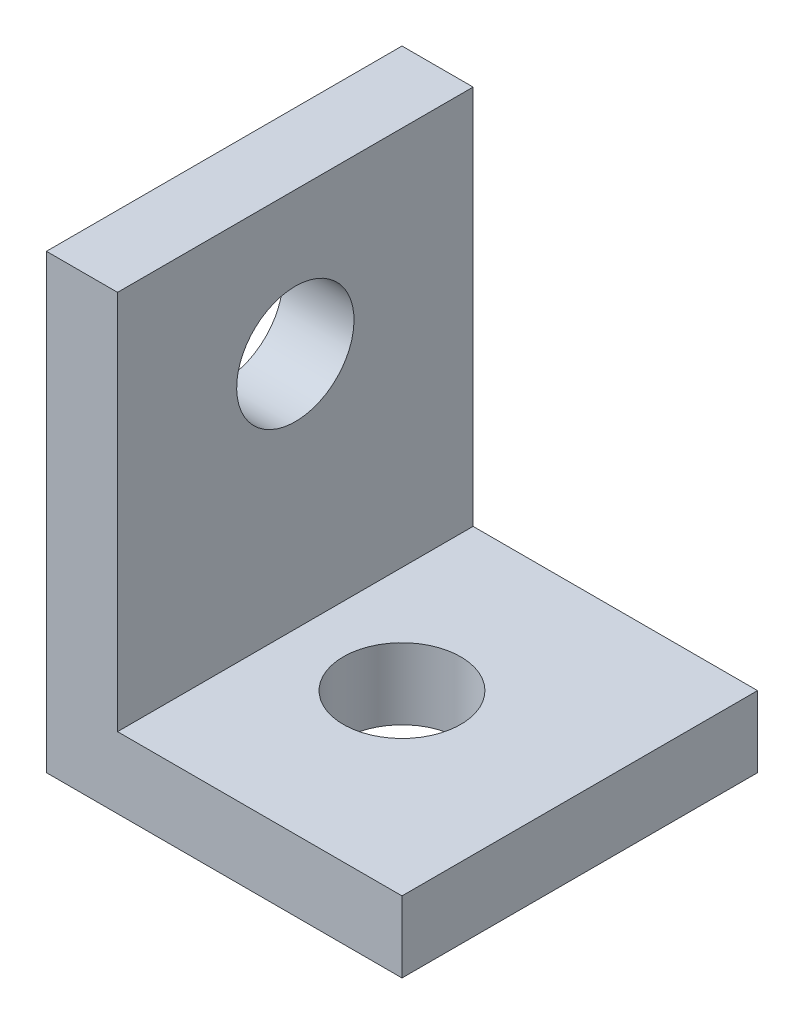
ISO-10303-21;
HEADER;
FILE_DESCRIPTION(('STEP AP214'),'2;1');
FILE_NAME('part.step','',(''),(''),'','','');
FILE_SCHEMA(('AUTOMOTIVE_DESIGN { 1 0 10303 214 1 1 1 1 }'));
ENDSEC;
DATA;
#1=APPLICATION_CONTEXT('core data for automotive mechanical design processes');
#2=APPLICATION_PROTOCOL_DEFINITION('international standard','automotive_design',2000,#1);
#3=PRODUCT_CONTEXT('',#1,'mechanical');
#4=PRODUCT('Part','Part','',(#3));
#5=PRODUCT_RELATED_PRODUCT_CATEGORY('part','',(#4));
#6=PRODUCT_DEFINITION_FORMATION('','',#4);
#7=PRODUCT_DEFINITION_CONTEXT('part definition',#1,'design');
#8=PRODUCT_DEFINITION('design','',#6,#7);
#9=PRODUCT_DEFINITION_SHAPE('','',#8);
#10=(LENGTH_UNIT() NAMED_UNIT(*) SI_UNIT(.MILLI.,.METRE.));
#11=(NAMED_UNIT(*) PLANE_ANGLE_UNIT() SI_UNIT($,.RADIAN.));
#12=(NAMED_UNIT(*) SI_UNIT($,.STERADIAN.) SOLID_ANGLE_UNIT());
#13=UNCERTAINTY_MEASURE_WITH_UNIT(LENGTH_MEASURE(1.E-05),#10,'distance_accuracy_value','');
#14=(GEOMETRIC_REPRESENTATION_CONTEXT(3) GLOBAL_UNCERTAINTY_ASSIGNED_CONTEXT((#13)) GLOBAL_UNIT_ASSIGNED_CONTEXT((#10,
#11,#12)) REPRESENTATION_CONTEXT('',''));
#15=CARTESIAN_POINT('',(0.,0.,0.));
#16=DIRECTION('',(0.,0.,1.));
#17=DIRECTION('',(1.,0.,0.));
#18=AXIS2_PLACEMENT_3D('',#15,#16,#17);
#19=CARTESIAN_POINT('',(-3.,6.35,5.));
#20=DIRECTION('',(0.,-1.,0.));
#21=DIRECTION('',(0.,0.,-1.));
#22=AXIS2_PLACEMENT_3D('',#19,#20,#21);
#23=PLANE('',#22);
#24=DIRECTION('',(-1.,0.,0.));
#25=VECTOR('',#24,1.);
#26=CARTESIAN_POINT('',(-3.,6.35,-5.));
#27=LINE('',#26,#25);
#28=CARTESIAN_POINT('',(-3.,6.35,-5.));
#29=VERTEX_POINT('',#28);
#30=CARTESIAN_POINT('',(-5.,6.35,-5.));
#31=VERTEX_POINT('',#30);
#32=EDGE_CURVE('E118',#29,#31,#27,.T.);
#33=ORIENTED_EDGE('',*,*,#32,.T.);
#34=DIRECTION('',(0.,0.,-1.));
#35=VECTOR('',#34,1.);
#36=CARTESIAN_POINT('',(-5.,6.35,5.));
#37=LINE('',#36,#35);
#38=CARTESIAN_POINT('',(-5.,6.35,5.));
#39=VERTEX_POINT('',#38);
#40=EDGE_CURVE('E11',#39,#31,#37,.T.);
#41=ORIENTED_EDGE('',*,*,#40,.F.);
#42=DIRECTION('',(-1.,0.,0.));
#43=VECTOR('',#42,1.);
#44=CARTESIAN_POINT('',(-3.,6.35,5.));
#45=LINE('',#44,#43);
#46=CARTESIAN_POINT('',(-3.,6.35,5.));
#47=VERTEX_POINT('',#46);
#48=EDGE_CURVE('E129',#47,#39,#45,.T.);
#49=ORIENTED_EDGE('',*,*,#48,.F.);
#50=DIRECTION('',(0.,0.,-1.));
#51=VECTOR('',#50,1.);
#52=CARTESIAN_POINT('',(-3.,6.35,5.));
#53=LINE('',#52,#51);
#54=EDGE_CURVE('E114',#47,#29,#53,.T.);
#55=ORIENTED_EDGE('',*,*,#54,.T.);
#56=EDGE_LOOP('',(#33,#41,#49,#55));
#57=FACE_BOUND('',#56,.T.);
#58=ADVANCED_FACE('F34',(#57),#23,.F.);
#59=CARTESIAN_POINT('',(-5.,6.35,5.));
#60=DIRECTION('',(1.,0.,0.));
#61=DIRECTION('',(0.,1.,0.));
#62=AXIS2_PLACEMENT_3D('',#59,#60,#61);
#63=PLANE('',#62);
#64=CARTESIAN_POINT('',(-5.,2.35,0.));
#65=DIRECTION('',(1.,0.,0.));
#66=DIRECTION('',(0.,1.,0.));
#67=AXIS2_PLACEMENT_3D('',#64,#65,#66);
#68=CIRCLE('',#67,1.65);
#69=CARTESIAN_POINT('',(-5.,4.,0.));
#70=VERTEX_POINT('',#69);
#71=EDGE_CURVE('E229',#70,#70,#68,.T.);
#72=ORIENTED_EDGE('',*,*,#71,.T.);
#73=EDGE_LOOP('',(#72));
#74=FACE_BOUND('',#73,.T.);
#75=DIRECTION('',(0.,-1.,0.));
#76=VECTOR('',#75,1.);
#77=CARTESIAN_POINT('',(-5.,6.35,-5.));
#78=LINE('',#77,#76);
#79=CARTESIAN_POINT('',(-5.,-6.35,-5.));
#80=VERTEX_POINT('',#79);
#81=EDGE_CURVE('E121',#31,#80,#78,.T.);
#82=ORIENTED_EDGE('',*,*,#81,.T.);
#83=DIRECTION('',(0.,0.,-1.));
#84=VECTOR('',#83,1.);
#85=CARTESIAN_POINT('',(-5.,-6.35,5.));
#86=LINE('',#85,#84);
#87=CARTESIAN_POINT('',(-5.,-6.35,5.));
#88=VERTEX_POINT('',#87);
#89=EDGE_CURVE('E42',#88,#80,#86,.T.);
#90=ORIENTED_EDGE('',*,*,#89,.F.);
#91=DIRECTION('',(0.,-1.,0.));
#92=VECTOR('',#91,1.);
#93=CARTESIAN_POINT('',(-5.,6.35,5.));
#94=LINE('',#93,#92);
#95=EDGE_CURVE('E87',#39,#88,#94,.T.);
#96=ORIENTED_EDGE('',*,*,#95,.F.);
#97=ORIENTED_EDGE('',*,*,#40,.T.);
#98=EDGE_LOOP('',(#82,#90,#96,#97));
#99=FACE_BOUND('',#98,.T.);
#100=ADVANCED_FACE('F156',(#74,#99),#63,.F.);
#101=CARTESIAN_POINT('',(-5.,-6.35,5.));
#102=DIRECTION('',(0.,1.,0.));
#103=DIRECTION('',(0.,0.,1.));
#104=AXIS2_PLACEMENT_3D('',#101,#102,#103);
#105=PLANE('',#104);
#106=CARTESIAN_POINT('',(0.,-6.35,0.));
#107=DIRECTION('',(0.,1.,0.));
#108=DIRECTION('',(-1.,0.,0.));
#109=AXIS2_PLACEMENT_3D('',#106,#107,#108);
#110=CIRCLE('',#109,1.65);
#111=CARTESIAN_POINT('',(-1.64999999999998,-6.35,0.));
#112=VERTEX_POINT('',#111);
#113=EDGE_CURVE('E122',#112,#112,#110,.T.);
#114=ORIENTED_EDGE('',*,*,#113,.T.);
#115=EDGE_LOOP('',(#114));
#116=FACE_BOUND('',#115,.T.);
#117=DIRECTION('',(1.,0.,0.));
#118=VECTOR('',#117,1.);
#119=CARTESIAN_POINT('',(-5.,-6.35,-5.));
#120=LINE('',#119,#118);
#121=CARTESIAN_POINT('',(5.,-6.35,-5.));
#122=VERTEX_POINT('',#121);
#123=EDGE_CURVE('E124',#80,#122,#120,.T.);
#124=ORIENTED_EDGE('',*,*,#123,.T.);
#125=DIRECTION('',(0.,0.,-1.));
#126=VECTOR('',#125,1.);
#127=CARTESIAN_POINT('',(5.,-6.35,5.));
#128=LINE('',#127,#126);
#129=CARTESIAN_POINT('',(5.,-6.35,5.));
#130=VERTEX_POINT('',#129);
#131=EDGE_CURVE('E109',#130,#122,#128,.T.);
#132=ORIENTED_EDGE('',*,*,#131,.F.);
#133=DIRECTION('',(1.,0.,0.));
#134=VECTOR('',#133,1.);
#135=CARTESIAN_POINT('',(-5.,-6.35,5.));
#136=LINE('',#135,#134);
#137=EDGE_CURVE('E100',#88,#130,#136,.T.);
#138=ORIENTED_EDGE('',*,*,#137,.F.);
#139=ORIENTED_EDGE('',*,*,#89,.T.);
#140=EDGE_LOOP('',(#124,#132,#138,#139));
#141=FACE_BOUND('',#140,.T.);
#142=ADVANCED_FACE('F135',(#116,#141),#105,.F.);
#143=CARTESIAN_POINT('',(5.,-6.35,5.));
#144=DIRECTION('',(-1.,0.,0.));
#145=DIRECTION('',(0.,0.,1.));
#146=AXIS2_PLACEMENT_3D('',#143,#144,#145);
#147=PLANE('',#146);
#148=DIRECTION('',(0.,1.,0.));
#149=VECTOR('',#148,1.);
#150=CARTESIAN_POINT('',(5.,-6.35,-5.));
#151=LINE('',#150,#149);
#152=CARTESIAN_POINT('',(5.,-4.35,-5.));
#153=VERTEX_POINT('',#152);
#154=EDGE_CURVE('E108',#122,#153,#151,.T.);
#155=ORIENTED_EDGE('',*,*,#154,.T.);
#156=DIRECTION('',(0.,0.,-1.));
#157=VECTOR('',#156,1.);
#158=CARTESIAN_POINT('',(5.,-4.35,5.));
#159=LINE('',#158,#157);
#160=CARTESIAN_POINT('',(5.,-4.35,5.));
#161=VERTEX_POINT('',#160);
#162=EDGE_CURVE('E105',#161,#153,#159,.T.);
#163=ORIENTED_EDGE('',*,*,#162,.F.);
#164=DIRECTION('',(0.,1.,0.));
#165=VECTOR('',#164,1.);
#166=CARTESIAN_POINT('',(5.,-6.35,5.));
#167=LINE('',#166,#165);
#168=EDGE_CURVE('E94',#130,#161,#167,.T.);
#169=ORIENTED_EDGE('',*,*,#168,.F.);
#170=ORIENTED_EDGE('',*,*,#131,.T.);
#171=EDGE_LOOP('',(#155,#163,#169,#170));
#172=FACE_BOUND('',#171,.T.);
#173=ADVANCED_FACE('F106',(#172),#147,.F.);
#174=CARTESIAN_POINT('',(5.,-4.35,5.));
#175=DIRECTION('',(0.,-1.,0.));
#176=DIRECTION('',(1.,0.,0.));
#177=AXIS2_PLACEMENT_3D('',#174,#175,#176);
#178=PLANE('',#177);
#179=CARTESIAN_POINT('',(0.,-4.35,0.));
#180=DIRECTION('',(0.,1.,0.));
#181=DIRECTION('',(-1.,0.,0.));
#182=AXIS2_PLACEMENT_3D('',#179,#180,#181);
#183=CIRCLE('',#182,1.65);
#184=CARTESIAN_POINT('',(-1.64999999999998,-4.35,0.));
#185=VERTEX_POINT('',#184);
#186=EDGE_CURVE('E230',#185,#185,#183,.T.);
#187=ORIENTED_EDGE('',*,*,#186,.F.);
#188=EDGE_LOOP('',(#187));
#189=FACE_BOUND('',#188,.T.);
#190=DIRECTION('',(-1.,0.,0.));
#191=VECTOR('',#190,1.);
#192=CARTESIAN_POINT('',(5.,-4.35,-5.));
#193=LINE('',#192,#191);
#194=CARTESIAN_POINT('',(-3.,-4.35,-5.));
#195=VERTEX_POINT('',#194);
#196=EDGE_CURVE('E73',#153,#195,#193,.T.);
#197=ORIENTED_EDGE('',*,*,#196,.T.);
#198=DIRECTION('',(0.,0.,-1.));
#199=VECTOR('',#198,1.);
#200=CARTESIAN_POINT('',(-3.,-4.35,5.));
#201=LINE('',#200,#199);
#202=CARTESIAN_POINT('',(-3.,-4.35,5.));
#203=VERTEX_POINT('',#202);
#204=EDGE_CURVE('E110',#203,#195,#201,.T.);
#205=ORIENTED_EDGE('',*,*,#204,.F.);
#206=DIRECTION('',(-1.,0.,0.));
#207=VECTOR('',#206,1.);
#208=CARTESIAN_POINT('',(5.,-4.35,5.));
#209=LINE('',#208,#207);
#210=EDGE_CURVE('E98',#161,#203,#209,.T.);
#211=ORIENTED_EDGE('',*,*,#210,.F.);
#212=ORIENTED_EDGE('',*,*,#162,.T.);
#213=EDGE_LOOP('',(#197,#205,#211,#212));
#214=FACE_BOUND('',#213,.T.);
#215=ADVANCED_FACE('F112',(#189,#214),#178,.F.);
#216=CARTESIAN_POINT('',(-3.,-4.35,5.));
#217=DIRECTION('',(-1.,0.,0.));
#218=DIRECTION('',(0.,0.,1.));
#219=AXIS2_PLACEMENT_3D('',#216,#217,#218);
#220=PLANE('',#219);
#221=CARTESIAN_POINT('',(-3.,2.35,0.));
#222=DIRECTION('',(1.,0.,0.));
#223=DIRECTION('',(0.,1.,0.));
#224=AXIS2_PLACEMENT_3D('',#221,#222,#223);
#225=CIRCLE('',#224,1.65);
#226=CARTESIAN_POINT('',(-3.00000000000001,4.,0.));
#227=VERTEX_POINT('',#226);
#228=EDGE_CURVE('E227',#227,#227,#225,.T.);
#229=ORIENTED_EDGE('',*,*,#228,.F.);
#230=EDGE_LOOP('',(#229));
#231=FACE_BOUND('',#230,.T.);
#232=DIRECTION('',(0.,1.,0.));
#233=VECTOR('',#232,1.);
#234=CARTESIAN_POINT('',(-3.,-4.35,-5.));
#235=LINE('',#234,#233);
#236=EDGE_CURVE('E79',#195,#29,#235,.T.);
#237=ORIENTED_EDGE('',*,*,#236,.T.);
#238=ORIENTED_EDGE('',*,*,#54,.F.);
#239=DIRECTION('',(0.,1.,0.));
#240=VECTOR('',#239,1.);
#241=CARTESIAN_POINT('',(-3.,-4.35,5.));
#242=LINE('',#241,#240);
#243=EDGE_CURVE('E50',#203,#47,#242,.T.);
#244=ORIENTED_EDGE('',*,*,#243,.F.);
#245=ORIENTED_EDGE('',*,*,#204,.T.);
#246=EDGE_LOOP('',(#237,#238,#244,#245));
#247=FACE_BOUND('',#246,.T.);
#248=ADVANCED_FACE('F142',(#231,#247),#220,.F.);
#249=CARTESIAN_POINT('',(0.,0.,5.));
#250=DIRECTION('',(0.,0.,1.));
#251=DIRECTION('',(1.,0.,0.));
#252=AXIS2_PLACEMENT_3D('',#249,#250,#251);
#253=PLANE('',#252);
#254=ORIENTED_EDGE('',*,*,#48,.T.);
#255=ORIENTED_EDGE('',*,*,#95,.T.);
#256=ORIENTED_EDGE('',*,*,#137,.T.);
#257=ORIENTED_EDGE('',*,*,#168,.T.);
#258=ORIENTED_EDGE('',*,*,#210,.T.);
#259=ORIENTED_EDGE('',*,*,#243,.T.);
#260=EDGE_LOOP('',(#254,#255,#256,#257,#258,#259));
#261=FACE_BOUND('',#260,.T.);
#262=ADVANCED_FACE('F96',(#261),#253,.T.);
#263=CARTESIAN_POINT('',(0.,0.,-5.));
#264=DIRECTION('',(0.,0.,1.));
#265=DIRECTION('',(1.,0.,0.));
#266=AXIS2_PLACEMENT_3D('',#263,#264,#265);
#267=PLANE('',#266);
#268=ORIENTED_EDGE('',*,*,#32,.F.);
#269=ORIENTED_EDGE('',*,*,#236,.F.);
#270=ORIENTED_EDGE('',*,*,#196,.F.);
#271=ORIENTED_EDGE('',*,*,#154,.F.);
#272=ORIENTED_EDGE('',*,*,#123,.F.);
#273=ORIENTED_EDGE('',*,*,#81,.F.);
#274=EDGE_LOOP('',(#268,#269,#270,#271,#272,#273));
#275=FACE_BOUND('',#274,.T.);
#276=ADVANCED_FACE('F138',(#275),#267,.F.);
#277=CARTESIAN_POINT('',(0.,-6.35,0.));
#278=DIRECTION('',(0.,1.,0.));
#279=DIRECTION('',(-1.,0.,0.));
#280=AXIS2_PLACEMENT_3D('',#277,#278,#279);
#281=CYLINDRICAL_SURFACE('',#280,1.65);
#282=ORIENTED_EDGE('',*,*,#113,.F.);
#283=EDGE_LOOP('',(#282));
#284=FACE_BOUND('',#283,.T.);
#285=ORIENTED_EDGE('',*,*,#186,.T.);
#286=EDGE_LOOP('',(#285));
#287=FACE_BOUND('',#286,.T.);
#288=ADVANCED_FACE('F187',(#284,#287),#281,.F.);
#289=CARTESIAN_POINT('',(-13.,2.34999999999999,0.));
#290=DIRECTION('',(1.,0.,0.));
#291=DIRECTION('',(0.,1.,0.));
#292=AXIS2_PLACEMENT_3D('',#289,#290,#291);
#293=CYLINDRICAL_SURFACE('',#292,1.65);
#294=ORIENTED_EDGE('',*,*,#228,.T.);
#295=EDGE_LOOP('',(#294));
#296=FACE_BOUND('',#295,.T.);
#297=ORIENTED_EDGE('',*,*,#71,.F.);
#298=EDGE_LOOP('',(#297));
#299=FACE_BOUND('',#298,.T.);
#300=ADVANCED_FACE('F191',(#296,#299),#293,.F.);
#301=CLOSED_SHELL('',(#58,#100,#142,#173,#215,#248,#262,#276,#288,#300));
#302=MANIFOLD_SOLID_BREP('B2',#301);
#303=ADVANCED_BREP_SHAPE_REPRESENTATION('',(#18,#302),#14);
#304=SHAPE_DEFINITION_REPRESENTATION(#9,#303);
ENDSEC;
END-ISO-10303-21;
